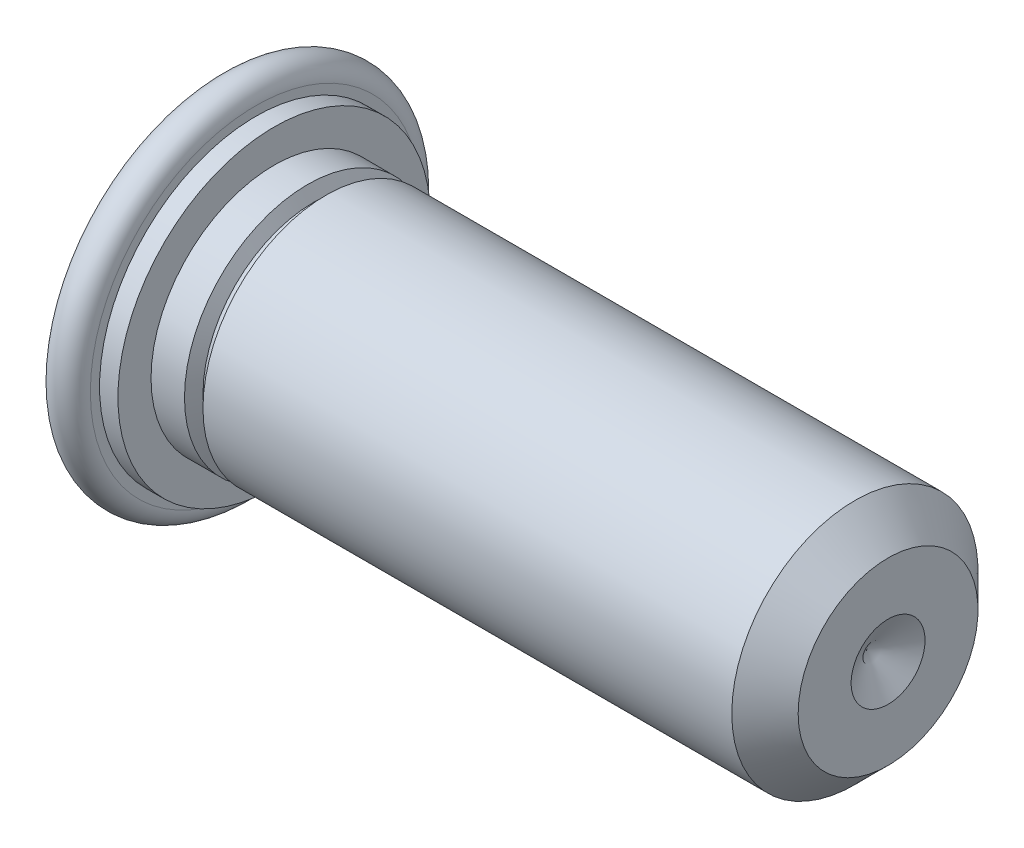
ISO-10303-21;
HEADER;
FILE_DESCRIPTION(('STEP AP214'),'2;1');
FILE_NAME('part.step','',(''),(''),'','','');
FILE_SCHEMA(('AUTOMOTIVE_DESIGN { 1 0 10303 214 1 1 1 1 }'));
ENDSEC;
DATA;
#1=APPLICATION_CONTEXT('core data for automotive mechanical design processes');
#2=APPLICATION_PROTOCOL_DEFINITION('international standard','automotive_design',2000,#1);
#3=PRODUCT_CONTEXT('',#1,'mechanical');
#4=PRODUCT('Part','Part','',(#3));
#5=PRODUCT_RELATED_PRODUCT_CATEGORY('part','',(#4));
#6=PRODUCT_DEFINITION_FORMATION('','',#4);
#7=PRODUCT_DEFINITION_CONTEXT('part definition',#1,'design');
#8=PRODUCT_DEFINITION('design','',#6,#7);
#9=PRODUCT_DEFINITION_SHAPE('','',#8);
#10=(LENGTH_UNIT() NAMED_UNIT(*) SI_UNIT(.MILLI.,.METRE.));
#11=(NAMED_UNIT(*) PLANE_ANGLE_UNIT() SI_UNIT($,.RADIAN.));
#12=(NAMED_UNIT(*) SI_UNIT($,.STERADIAN.) SOLID_ANGLE_UNIT());
#13=UNCERTAINTY_MEASURE_WITH_UNIT(LENGTH_MEASURE(1.E-05),#10,'distance_accuracy_value','');
#14=(GEOMETRIC_REPRESENTATION_CONTEXT(3) GLOBAL_UNCERTAINTY_ASSIGNED_CONTEXT((#13)) GLOBAL_UNIT_ASSIGNED_CONTEXT((#10,
#11,#12)) REPRESENTATION_CONTEXT('',''));
#15=CARTESIAN_POINT('',(0.,0.,0.));
#16=DIRECTION('',(0.,0.,1.));
#17=DIRECTION('',(1.,0.,0.));
#18=AXIS2_PLACEMENT_3D('',#15,#16,#17);
#19=CARTESIAN_POINT('',(0.,0.,1.17729));
#20=DIRECTION('',(-1.,0.,0.));
#21=DIRECTION('',(0.,0.,1.));
#22=AXIS2_PLACEMENT_3D('',#19,#20,#21);
#23=PLANE('',#22);
#24=CARTESIAN_POINT('',(2.53999994865098E-09,0.,0.));
#25=DIRECTION('',(1.,0.,0.));
#26=DIRECTION('',(0.,0.,-1.));
#27=AXIS2_PLACEMENT_3D('',#24,#25,#26);
#28=CIRCLE('',#27,2.35458000000035);
#29=CARTESIAN_POINT('',(1.52400016733921E-09,0.,-2.35458000000018));
#30=VERTEX_POINT('',#29);
#31=CARTESIAN_POINT('',(1.52399987161239E-09,0.,2.35458000000022));
#32=VERTEX_POINT('',#31);
#33=EDGE_CURVE('E44',#30,#32,#28,.T.);
#34=ORIENTED_EDGE('',*,*,#33,.F.);
#35=CARTESIAN_POINT('',(2.53999994865098E-09,0.,0.));
#36=DIRECTION('',(1.,0.,0.));
#37=DIRECTION('',(0.,0.,1.));
#38=AXIS2_PLACEMENT_3D('',#35,#36,#37);
#39=CIRCLE('',#38,2.35458000000035);
#40=EDGE_CURVE('E48',#32,#30,#39,.T.);
#41=ORIENTED_EDGE('',*,*,#40,.F.);
#42=EDGE_LOOP('',(#34,#41));
#43=FACE_BOUND('',#42,.T.);
#44=ADVANCED_FACE('F17',(#43),#23,.T.);
#45=CARTESIAN_POINT('',(0.26162,0.,0.));
#46=DIRECTION('',(-1.,0.,0.));
#47=DIRECTION('',(0.,0.,1.));
#48=AXIS2_PLACEMENT_3D('',#45,#46,#47);
#49=TOROIDAL_SURFACE('',#48,2.35461645585822,0.26162);
#50=ORIENTED_EDGE('',*,*,#33,.T.);
#51=ORIENTED_EDGE('',*,*,#40,.T.);
#52=EDGE_LOOP('',(#50,#51));
#53=FACE_BOUND('',#52,.T.);
#54=CARTESIAN_POINT('',(0.52323999746,0.,0.));
#55=DIRECTION('',(-1.,0.,0.));
#56=DIRECTION('',(0.,0.,1.));
#57=AXIS2_PLACEMENT_3D('',#54,#55,#56);
#58=CIRCLE('',#57,2.3545800000002);
#59=CARTESIAN_POINT('',(0.523239997968,0.,-2.35458000000033));
#60=VERTEX_POINT('',#59);
#61=CARTESIAN_POINT('',(0.523239997968,0.,2.3545800000003));
#62=VERTEX_POINT('',#61);
#63=EDGE_CURVE('E55',#60,#62,#58,.F.);
#64=ORIENTED_EDGE('',*,*,#63,.F.);
#65=CARTESIAN_POINT('',(0.52323999746,0.,0.));
#66=DIRECTION('',(-1.,0.,0.));
#67=DIRECTION('',(0.,0.,-1.));
#68=AXIS2_PLACEMENT_3D('',#65,#66,#67);
#69=CIRCLE('',#68,2.35458000000038);
#70=EDGE_CURVE('E84',#62,#60,#69,.F.);
#71=ORIENTED_EDGE('',*,*,#70,.F.);
#72=EDGE_LOOP('',(#64,#71));
#73=FACE_BOUND('',#72,.T.);
#74=ADVANCED_FACE('F53',(#53,#73),#49,.T.);
#75=CARTESIAN_POINT('',(0.52323999873,0.,2.05359000000018));
#76=DIRECTION('',(1.,0.,0.));
#77=DIRECTION('',(0.,0.,-1.));
#78=AXIS2_PLACEMENT_3D('',#75,#76,#77);
#79=PLANE('',#78);
#80=ORIENTED_EDGE('',*,*,#63,.T.);
#81=ORIENTED_EDGE('',*,*,#70,.T.);
#82=EDGE_LOOP('',(#80,#81));
#83=FACE_BOUND('',#82,.T.);
#84=CARTESIAN_POINT('',(0.523239998730001,0.,0.));
#85=DIRECTION('',(1.,0.,0.));
#86=DIRECTION('',(0.,0.,-1.));
#87=AXIS2_PLACEMENT_3D('',#84,#85,#86);
#88=CIRCLE('',#87,2.22377);
#89=CARTESIAN_POINT('',(0.523239998730001,0.,-2.22377));
#90=VERTEX_POINT('',#89);
#91=EDGE_CURVE('E94',#90,#90,#88,.T.);
#92=ORIENTED_EDGE('',*,*,#91,.F.);
#93=EDGE_LOOP('',(#92));
#94=FACE_BOUND('',#93,.T.);
#95=ADVANCED_FACE('F72',(#83,#94),#79,.T.);
#96=CARTESIAN_POINT('',(0.65405,0.,0.));
#97=DIRECTION('',(1.,0.,0.));
#98=DIRECTION('',(0.,0.,-1.));
#99=AXIS2_PLACEMENT_3D('',#96,#97,#98);
#100=CYLINDRICAL_SURFACE('',#99,2.22377);
#101=CARTESIAN_POINT('',(0.784860000000001,0.,0.));
#102=DIRECTION('',(1.,0.,0.));
#103=DIRECTION('',(0.,0.,-1.));
#104=AXIS2_PLACEMENT_3D('',#101,#102,#103);
#105=CIRCLE('',#104,2.22377);
#106=CARTESIAN_POINT('',(0.784860000000001,0.,-2.22377));
#107=VERTEX_POINT('',#106);
#108=EDGE_CURVE('E183',#107,#107,#105,.T.);
#109=ORIENTED_EDGE('',*,*,#108,.F.);
#110=EDGE_LOOP('',(#109));
#111=FACE_BOUND('',#110,.T.);
#112=ORIENTED_EDGE('',*,*,#91,.T.);
#113=EDGE_LOOP('',(#112));
#114=FACE_BOUND('',#113,.T.);
#115=ADVANCED_FACE('F144',(#111,#114),#100,.T.);
#116=CARTESIAN_POINT('',(0.78486,0.,0.));
#117=DIRECTION('',(1.,0.,0.));
#118=DIRECTION('',(0.,0.,-1.));
#119=AXIS2_PLACEMENT_3D('',#116,#117,#118);
#120=PLANE('',#119);
#121=ORIENTED_EDGE('',*,*,#108,.T.);
#122=EDGE_LOOP('',(#121));
#123=FACE_BOUND('',#122,.T.);
#124=CARTESIAN_POINT('',(0.784860000000001,0.,0.));
#125=DIRECTION('',(-1.,0.,0.));
#126=DIRECTION('',(0.,0.,1.));
#127=AXIS2_PLACEMENT_3D('',#124,#125,#126);
#128=CIRCLE('',#127,1.7526);
#129=CARTESIAN_POINT('',(0.784860000000001,0.,1.7526));
#130=VERTEX_POINT('',#129);
#131=EDGE_CURVE('E110',#130,#130,#128,.F.);
#132=ORIENTED_EDGE('',*,*,#131,.F.);
#133=EDGE_LOOP('',(#132));
#134=FACE_BOUND('',#133,.T.);
#135=ADVANCED_FACE('F141',(#123,#134),#120,.T.);
#136=CARTESIAN_POINT('',(4.7879,0.,0.));
#137=DIRECTION('',(-1.,0.,0.));
#138=DIRECTION('',(0.,0.,1.));
#139=AXIS2_PLACEMENT_3D('',#136,#137,#138);
#140=CYLINDRICAL_SURFACE('',#139,1.7526);
#141=ORIENTED_EDGE('',*,*,#131,.T.);
#142=EDGE_LOOP('',(#141));
#143=FACE_BOUND('',#142,.T.);
#144=CARTESIAN_POINT('',(1.26111000093942,0.,0.));
#145=DIRECTION('',(-1.,0.,0.));
#146=DIRECTION('',(0.,0.,-1.));
#147=AXIS2_PLACEMENT_3D('',#144,#145,#146);
#148=CIRCLE('',#147,1.75260000048638);
#149=CARTESIAN_POINT('',(1.26111000093942,0.,-1.75260000048638));
#150=VERTEX_POINT('',#149);
#151=EDGE_CURVE('E99',#150,#150,#148,.F.);
#152=ORIENTED_EDGE('',*,*,#151,.F.);
#153=EDGE_LOOP('',(#152));
#154=FACE_BOUND('',#153,.T.);
#155=ADVANCED_FACE('F137',(#143,#154),#140,.T.);
#156=CARTESIAN_POINT('',(1.26111000093942,0.,0.));
#157=DIRECTION('',(-1.,0.,0.));
#158=DIRECTION('',(0.,0.,1.));
#159=AXIS2_PLACEMENT_3D('',#156,#157,#158);
#160=CONICAL_SURFACE('',#159,1.75260000048638,1.10714871766436);
#161=CARTESIAN_POINT('',(1.34874000127,0.,0.));
#162=DIRECTION('',(-1.,0.,0.));
#163=DIRECTION('',(0.,0.,1.));
#164=AXIS2_PLACEMENT_3D('',#161,#162,#163);
#165=CIRCLE('',#164,1.5773400021997);
#166=CARTESIAN_POINT('',(1.34874000127,0.,1.5773400021997));
#167=VERTEX_POINT('',#166);
#168=EDGE_CURVE('E109',#167,#167,#165,.T.);
#169=ORIENTED_EDGE('',*,*,#168,.T.);
#170=EDGE_LOOP('',(#169));
#171=FACE_BOUND('',#170,.T.);
#172=ORIENTED_EDGE('',*,*,#151,.T.);
#173=EDGE_LOOP('',(#172));
#174=FACE_BOUND('',#173,.T.);
#175=ADVANCED_FACE('F134',(#171,#174),#160,.T.);
#176=CARTESIAN_POINT('',(9.52499999993961,0.,0.));
#177=DIRECTION('',(1.,0.,0.));
#178=DIRECTION('',(0.,0.,-1.));
#179=AXIS2_PLACEMENT_3D('',#176,#177,#178);
#180=CONICAL_SURFACE('',#179,0.525779999918541,1.04719755064672);
#181=CARTESIAN_POINT('',(9.22144077537723,0.,1.98951966012828E-10));
#182=VERTEX_POINT('',#181);
#183=VERTEX_LOOP('',#182);
#184=FACE_BOUND('',#183,.T.);
#185=CARTESIAN_POINT('',(9.52499999993961,0.,0.));
#186=DIRECTION('',(1.,0.,0.));
#187=DIRECTION('',(0.,0.,-1.));
#188=AXIS2_PLACEMENT_3D('',#185,#186,#187);
#189=CIRCLE('',#188,0.525779999918541);
#190=CARTESIAN_POINT('',(9.52499999993961,0.,-0.525779999918541));
#191=VERTEX_POINT('',#190);
#192=EDGE_CURVE('E113',#191,#191,#189,.F.);
#193=ORIENTED_EDGE('',*,*,#192,.F.);
#194=EDGE_LOOP('',(#193));
#195=FACE_BOUND('',#194,.T.);
#196=ADVANCED_FACE('F130',(#184,#195),#180,.F.);
#197=CARTESIAN_POINT('',(9.525,0.,0.64008));
#198=DIRECTION('',(1.,0.,0.));
#199=DIRECTION('',(0.,0.,-1.));
#200=AXIS2_PLACEMENT_3D('',#197,#198,#199);
#201=PLANE('',#200);
#202=CARTESIAN_POINT('',(9.52499999982592,0.,0.));
#203=DIRECTION('',(-1.,0.,0.));
#204=DIRECTION('',(0.,0.,1.));
#205=AXIS2_PLACEMENT_3D('',#202,#203,#204);
#206=CIRCLE('',#205,1.28016000013531);
#207=CARTESIAN_POINT('',(9.52499999982592,0.,1.28016000013531));
#208=VERTEX_POINT('',#207);
#209=EDGE_CURVE('E170',#208,#208,#206,.T.);
#210=ORIENTED_EDGE('',*,*,#209,.F.);
#211=EDGE_LOOP('',(#210));
#212=FACE_BOUND('',#211,.T.);
#213=ORIENTED_EDGE('',*,*,#192,.T.);
#214=EDGE_LOOP('',(#213));
#215=FACE_BOUND('',#214,.T.);
#216=ADVANCED_FACE('F125',(#212,#215),#201,.T.);
#217=CARTESIAN_POINT('',(1.392555,0.,0.));
#218=DIRECTION('',(-1.,0.,0.));
#219=DIRECTION('',(0.,0.,1.));
#220=AXIS2_PLACEMENT_3D('',#217,#218,#219);
#221=TOROIDAL_SURFACE('',#220,1.65322980906657,0.0876299999999997);
#222=ORIENTED_EDGE('',*,*,#168,.F.);
#223=EDGE_LOOP('',(#222));
#224=FACE_BOUND('',#223,.T.);
#225=CARTESIAN_POINT('',(1.4363699999933,0.,0.));
#226=DIRECTION('',(1.,0.,0.));
#227=DIRECTION('',(0.,0.,-1.));
#228=AXIS2_PLACEMENT_3D('',#225,#226,#227);
#229=CIRCLE('',#228,1.57733999992615);
#230=CARTESIAN_POINT('',(1.4363699999933,0.,-1.57733999992615));
#231=VERTEX_POINT('',#230);
#232=EDGE_CURVE('E116',#231,#231,#229,.T.);
#233=ORIENTED_EDGE('',*,*,#232,.F.);
#234=EDGE_LOOP('',(#233));
#235=FACE_BOUND('',#234,.T.);
#236=ADVANCED_FACE('F120',(#224,#235),#221,.F.);
#237=CARTESIAN_POINT('',(9.05255999998644,0.,0.));
#238=DIRECTION('',(-1.,0.,0.));
#239=DIRECTION('',(0.,0.,1.));
#240=AXIS2_PLACEMENT_3D('',#237,#238,#239);
#241=CONICAL_SURFACE('',#240,1.75260000003163,0.785398163457608);
#242=ORIENTED_EDGE('',*,*,#209,.T.);
#243=EDGE_LOOP('',(#242));
#244=FACE_BOUND('',#243,.T.);
#245=CARTESIAN_POINT('',(9.05256,0.,0.));
#246=DIRECTION('',(-1.,0.,0.));
#247=DIRECTION('',(0.,0.,1.));
#248=AXIS2_PLACEMENT_3D('',#245,#246,#247);
#249=CIRCLE('',#248,1.7526);
#250=CARTESIAN_POINT('',(9.05256,0.,1.7526));
#251=VERTEX_POINT('',#250);
#252=EDGE_CURVE('E28',#251,#251,#249,.T.);
#253=ORIENTED_EDGE('',*,*,#252,.F.);
#254=EDGE_LOOP('',(#253));
#255=FACE_BOUND('',#254,.T.);
#256=ADVANCED_FACE('F124',(#244,#255),#241,.T.);
#257=CARTESIAN_POINT('',(1.52400000004604,0.,0.));
#258=DIRECTION('',(1.,0.,0.));
#259=DIRECTION('',(0.,1.,0.));
#260=AXIS2_PLACEMENT_3D('',#257,#258,#259);
#261=CONICAL_SURFACE('',#260,1.75259999997479,1.10714871766436);
#262=CARTESIAN_POINT('',(1.524,0.,0.));
#263=DIRECTION('',(-1.,0.,0.));
#264=DIRECTION('',(0.,0.,1.));
#265=AXIS2_PLACEMENT_3D('',#262,#263,#264);
#266=CIRCLE('',#265,1.7526);
#267=CARTESIAN_POINT('',(1.524,0.,1.7526));
#268=VERTEX_POINT('',#267);
#269=EDGE_CURVE('E10',#268,#268,#266,.F.);
#270=ORIENTED_EDGE('',*,*,#269,.F.);
#271=EDGE_LOOP('',(#270));
#272=FACE_BOUND('',#271,.T.);
#273=ORIENTED_EDGE('',*,*,#232,.T.);
#274=EDGE_LOOP('',(#273));
#275=FACE_BOUND('',#274,.T.);
#276=ADVANCED_FACE('F156',(#272,#275),#261,.T.);
#277=CARTESIAN_POINT('',(4.7879,0.,0.));
#278=DIRECTION('',(-1.,0.,0.));
#279=DIRECTION('',(0.,0.,1.));
#280=AXIS2_PLACEMENT_3D('',#277,#278,#279);
#281=CYLINDRICAL_SURFACE('',#280,1.7526);
#282=ORIENTED_EDGE('',*,*,#252,.T.);
#283=EDGE_LOOP('',(#282));
#284=FACE_BOUND('',#283,.T.);
#285=ORIENTED_EDGE('',*,*,#269,.T.);
#286=EDGE_LOOP('',(#285));
#287=FACE_BOUND('',#286,.T.);
#288=ADVANCED_FACE('F154',(#284,#287),#281,.T.);
#289=CLOSED_SHELL('',(#44,#74,#95,#115,#135,#155,#175,#196,#216,#236,#256,#276,#288));
#290=MANIFOLD_SOLID_BREP('B1',#289);
#291=ADVANCED_BREP_SHAPE_REPRESENTATION('',(#18,#290),#14);
#292=SHAPE_DEFINITION_REPRESENTATION(#9,#291);
ENDSEC;
END-ISO-10303-21;
